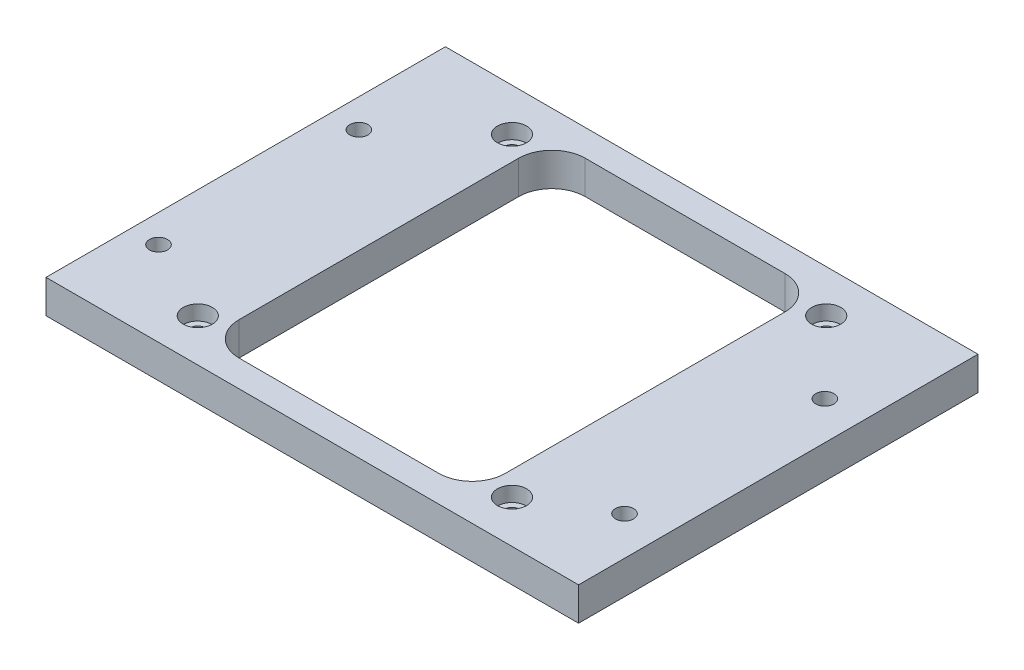
ISO-10303-21;
HEADER;
FILE_DESCRIPTION(('STEP AP214'),'2;1');
FILE_NAME('part.step','',(''),(''),'','','');
FILE_SCHEMA(('AUTOMOTIVE_DESIGN { 1 0 10303 214 1 1 1 1 }'));
ENDSEC;
DATA;
#1=APPLICATION_CONTEXT('core data for automotive mechanical design processes');
#2=APPLICATION_PROTOCOL_DEFINITION('international standard','automotive_design',2000,#1);
#3=PRODUCT_CONTEXT('',#1,'mechanical');
#4=PRODUCT('Part','Part','',(#3));
#5=PRODUCT_RELATED_PRODUCT_CATEGORY('part','',(#4));
#6=PRODUCT_DEFINITION_FORMATION('','',#4);
#7=PRODUCT_DEFINITION_CONTEXT('part definition',#1,'design');
#8=PRODUCT_DEFINITION('design','',#6,#7);
#9=PRODUCT_DEFINITION_SHAPE('','',#8);
#10=(LENGTH_UNIT() NAMED_UNIT(*) SI_UNIT(.MILLI.,.METRE.));
#11=(NAMED_UNIT(*) PLANE_ANGLE_UNIT() SI_UNIT($,.RADIAN.));
#12=(NAMED_UNIT(*) SI_UNIT($,.STERADIAN.) SOLID_ANGLE_UNIT());
#13=UNCERTAINTY_MEASURE_WITH_UNIT(LENGTH_MEASURE(1.E-05),#10,'distance_accuracy_value','');
#14=(GEOMETRIC_REPRESENTATION_CONTEXT(3) GLOBAL_UNCERTAINTY_ASSIGNED_CONTEXT((#13)) GLOBAL_UNIT_ASSIGNED_CONTEXT((#10,
#11,#12)) REPRESENTATION_CONTEXT('',''));
#15=CARTESIAN_POINT('',(0.,0.,0.));
#16=DIRECTION('',(0.,0.,1.));
#17=DIRECTION('',(1.,0.,0.));
#18=AXIS2_PLACEMENT_3D('',#15,#16,#17);
#19=CARTESIAN_POINT('',(0.,6.35,0.));
#20=DIRECTION('',(0.,1.,0.));
#21=DIRECTION('',(0.,0.,1.));
#22=AXIS2_PLACEMENT_3D('',#19,#20,#21);
#23=PLANE('',#22);
#24=CARTESIAN_POINT('',(-45.339,6.35,-16.129));
#25=DIRECTION('',(0.,1.,0.));
#26=DIRECTION('',(0.,0.,1.));
#27=AXIS2_PLACEMENT_3D('',#24,#25,#26);
#28=CIRCLE('',#27,1.7272);
#29=CARTESIAN_POINT('',(-45.339,6.35,-14.4018));
#30=VERTEX_POINT('',#29);
#31=EDGE_CURVE('E357',#30,#30,#28,.T.);
#32=ORIENTED_EDGE('',*,*,#31,.F.);
#33=EDGE_LOOP('',(#32));
#34=FACE_BOUND('',#33,.T.);
#35=CARTESIAN_POINT('',(-45.466,6.35,21.971));
#36=DIRECTION('',(0.,1.,0.));
#37=DIRECTION('',(0.,0.,1.));
#38=AXIS2_PLACEMENT_3D('',#35,#36,#37);
#39=CIRCLE('',#38,1.7272);
#40=CARTESIAN_POINT('',(-45.466,6.35,23.6982));
#41=VERTEX_POINT('',#40);
#42=EDGE_CURVE('E359',#41,#41,#39,.T.);
#43=ORIENTED_EDGE('',*,*,#42,.F.);
#44=EDGE_LOOP('',(#43));
#45=FACE_BOUND('',#44,.T.);
#46=CARTESIAN_POINT('',(43.561,6.35,-16.129));
#47=DIRECTION('',(0.,1.,0.));
#48=DIRECTION('',(0.,0.,1.));
#49=AXIS2_PLACEMENT_3D('',#46,#47,#48);
#50=CIRCLE('',#49,1.7272);
#51=CARTESIAN_POINT('',(43.561,6.35,-14.4018));
#52=VERTEX_POINT('',#51);
#53=EDGE_CURVE('E367',#52,#52,#50,.T.);
#54=ORIENTED_EDGE('',*,*,#53,.F.);
#55=EDGE_LOOP('',(#54));
#56=FACE_BOUND('',#55,.T.);
#57=CARTESIAN_POINT('',(43.434,6.35,21.971));
#58=DIRECTION('',(0.,1.,0.));
#59=DIRECTION('',(0.,0.,1.));
#60=AXIS2_PLACEMENT_3D('',#57,#58,#59);
#61=CIRCLE('',#60,1.7272);
#62=CARTESIAN_POINT('',(43.434,6.35,23.6982));
#63=VERTEX_POINT('',#62);
#64=EDGE_CURVE('E373',#63,#63,#61,.T.);
#65=ORIENTED_EDGE('',*,*,#64,.F.);
#66=EDGE_LOOP('',(#65));
#67=FACE_BOUND('',#66,.T.);
#68=CARTESIAN_POINT('',(-29.972,6.35,-29.972));
#69=DIRECTION('',(0.,1.,0.));
#70=DIRECTION('',(0.,0.,1.));
#71=AXIS2_PLACEMENT_3D('',#68,#69,#70);
#72=CIRCLE('',#71,2.77875999999999);
#73=CARTESIAN_POINT('',(-29.972,6.35,-27.19324));
#74=VERTEX_POINT('',#73);
#75=EDGE_CURVE('E379',#74,#74,#72,.T.);
#76=ORIENTED_EDGE('',*,*,#75,.F.);
#77=EDGE_LOOP('',(#76));
#78=FACE_BOUND('',#77,.T.);
#79=CARTESIAN_POINT('',(29.972,6.35,-29.972));
#80=DIRECTION('',(0.,1.,0.));
#81=DIRECTION('',(0.,0.,1.));
#82=AXIS2_PLACEMENT_3D('',#79,#80,#81);
#83=CIRCLE('',#82,2.77875999999999);
#84=CARTESIAN_POINT('',(29.972,6.35,-27.19324));
#85=VERTEX_POINT('',#84);
#86=EDGE_CURVE('E391',#85,#85,#83,.T.);
#87=ORIENTED_EDGE('',*,*,#86,.F.);
#88=EDGE_LOOP('',(#87));
#89=FACE_BOUND('',#88,.T.);
#90=CARTESIAN_POINT('',(29.972,6.35,29.972));
#91=DIRECTION('',(0.,1.,0.));
#92=DIRECTION('',(0.,0.,1.));
#93=AXIS2_PLACEMENT_3D('',#90,#91,#92);
#94=CIRCLE('',#93,2.77875999999999);
#95=CARTESIAN_POINT('',(29.972,6.35,32.75076));
#96=VERTEX_POINT('',#95);
#97=EDGE_CURVE('E403',#96,#96,#94,.T.);
#98=ORIENTED_EDGE('',*,*,#97,.F.);
#99=EDGE_LOOP('',(#98));
#100=FACE_BOUND('',#99,.T.);
#101=CARTESIAN_POINT('',(-29.972,6.35,29.972));
#102=DIRECTION('',(0.,1.,0.));
#103=DIRECTION('',(0.,0.,1.));
#104=AXIS2_PLACEMENT_3D('',#101,#102,#103);
#105=CIRCLE('',#104,2.77875999999999);
#106=CARTESIAN_POINT('',(-29.972,6.35,32.75076));
#107=VERTEX_POINT('',#106);
#108=EDGE_CURVE('E415',#107,#107,#105,.T.);
#109=ORIENTED_EDGE('',*,*,#108,.F.);
#110=EDGE_LOOP('',(#109));
#111=FACE_BOUND('',#110,.T.);
#112=DIRECTION('',(0.,0.,1.));
#113=VECTOR('',#112,1.);
#114=CARTESIAN_POINT('',(-50.8,6.35,-38.1));
#115=LINE('',#114,#113);
#116=CARTESIAN_POINT('',(-50.8,6.35,-38.1));
#117=VERTEX_POINT('',#116);
#118=CARTESIAN_POINT('',(-50.8,6.35,38.1));
#119=VERTEX_POINT('',#118);
#120=EDGE_CURVE('E191',#117,#119,#115,.T.);
#121=ORIENTED_EDGE('',*,*,#120,.T.);
#122=DIRECTION('',(1.,0.,0.));
#123=VECTOR('',#122,1.);
#124=CARTESIAN_POINT('',(-50.8,6.35,38.1));
#125=LINE('',#124,#123);
#126=CARTESIAN_POINT('',(50.8,6.35,38.1));
#127=VERTEX_POINT('',#126);
#128=EDGE_CURVE('E194',#119,#127,#125,.T.);
#129=ORIENTED_EDGE('',*,*,#128,.T.);
#130=DIRECTION('',(0.,0.,-1.));
#131=VECTOR('',#130,1.);
#132=CARTESIAN_POINT('',(50.8,6.35,-38.1));
#133=LINE('',#132,#131);
#134=CARTESIAN_POINT('',(50.8,6.35,-38.1));
#135=VERTEX_POINT('',#134);
#136=EDGE_CURVE('E197',#127,#135,#133,.T.);
#137=ORIENTED_EDGE('',*,*,#136,.T.);
#138=DIRECTION('',(-1.,0.,0.));
#139=VECTOR('',#138,1.);
#140=CARTESIAN_POINT('',(-50.8,6.35,-38.1));
#141=LINE('',#140,#139);
#142=EDGE_CURVE('E199',#135,#117,#141,.T.);
#143=ORIENTED_EDGE('',*,*,#142,.T.);
#144=EDGE_LOOP('',(#121,#129,#137,#143));
#145=FACE_BOUND('',#144,.T.);
#146=DIRECTION('',(0.,0.,-1.));
#147=VECTOR('',#146,1.);
#148=CARTESIAN_POINT('',(25.4,6.35,-26.67));
#149=LINE('',#148,#147);
#150=CARTESIAN_POINT('',(25.4,6.35,26.67));
#151=VERTEX_POINT('',#150);
#152=CARTESIAN_POINT('',(25.4,6.35,-26.67));
#153=VERTEX_POINT('',#152);
#154=EDGE_CURVE('E132',#151,#153,#149,.T.);
#155=ORIENTED_EDGE('',*,*,#154,.F.);
#156=CARTESIAN_POINT('',(19.05,6.35,26.67));
#157=DIRECTION('',(0.,1.,0.));
#158=DIRECTION('',(0.,0.,1.));
#159=AXIS2_PLACEMENT_3D('',#156,#157,#158);
#160=CIRCLE('',#159,6.35);
#161=CARTESIAN_POINT('',(19.05,6.35,33.02));
#162=VERTEX_POINT('',#161);
#163=EDGE_CURVE('E124',#162,#151,#160,.T.);
#164=ORIENTED_EDGE('',*,*,#163,.F.);
#165=DIRECTION('',(1.,0.,0.));
#166=VECTOR('',#165,1.);
#167=CARTESIAN_POINT('',(-19.05,6.35,33.02));
#168=LINE('',#167,#166);
#169=CARTESIAN_POINT('',(-19.05,6.35,33.02));
#170=VERTEX_POINT('',#169);
#171=EDGE_CURVE('E158',#170,#162,#168,.T.);
#172=ORIENTED_EDGE('',*,*,#171,.F.);
#173=CARTESIAN_POINT('',(-19.05,6.35,26.67));
#174=DIRECTION('',(0.,1.,0.));
#175=DIRECTION('',(0.,0.,-1.));
#176=AXIS2_PLACEMENT_3D('',#173,#174,#175);
#177=CIRCLE('',#176,6.35);
#178=CARTESIAN_POINT('',(-25.4,6.35,26.67));
#179=VERTEX_POINT('',#178);
#180=EDGE_CURVE('E156',#179,#170,#177,.T.);
#181=ORIENTED_EDGE('',*,*,#180,.F.);
#182=DIRECTION('',(0.,0.,1.));
#183=VECTOR('',#182,1.);
#184=CARTESIAN_POINT('',(-25.4,6.35,-26.67));
#185=LINE('',#184,#183);
#186=CARTESIAN_POINT('',(-25.4,6.35,-26.67));
#187=VERTEX_POINT('',#186);
#188=EDGE_CURVE('E154',#187,#179,#185,.T.);
#189=ORIENTED_EDGE('',*,*,#188,.F.);
#190=CARTESIAN_POINT('',(-19.05,6.35,-26.67));
#191=DIRECTION('',(0.,1.,0.));
#192=DIRECTION('',(0.,0.,1.));
#193=AXIS2_PLACEMENT_3D('',#190,#191,#192);
#194=CIRCLE('',#193,6.35);
#195=CARTESIAN_POINT('',(-19.05,6.35,-33.02));
#196=VERTEX_POINT('',#195);
#197=EDGE_CURVE('E152',#196,#187,#194,.T.);
#198=ORIENTED_EDGE('',*,*,#197,.F.);
#199=DIRECTION('',(-1.,0.,0.));
#200=VECTOR('',#199,1.);
#201=CARTESIAN_POINT('',(-19.05,6.35,-33.02));
#202=LINE('',#201,#200);
#203=CARTESIAN_POINT('',(19.05,6.35,-33.02));
#204=VERTEX_POINT('',#203);
#205=EDGE_CURVE('E147',#204,#196,#202,.T.);
#206=ORIENTED_EDGE('',*,*,#205,.F.);
#207=CARTESIAN_POINT('',(19.05,6.35,-26.67));
#208=DIRECTION('',(0.,1.,0.));
#209=DIRECTION('',(0.,0.,-1.));
#210=AXIS2_PLACEMENT_3D('',#207,#208,#209);
#211=CIRCLE('',#210,6.35);
#212=EDGE_CURVE('E145',#153,#204,#211,.T.);
#213=ORIENTED_EDGE('',*,*,#212,.F.);
#214=EDGE_LOOP('',(#155,#164,#172,#181,#189,#198,#206,#213));
#215=FACE_BOUND('',#214,.T.);
#216=ADVANCED_FACE('F35',(#34,#45,#56,#67,#78,#89,#100,#111,#145,#215),#23,.T.);
#217=CARTESIAN_POINT('',(0.,0.,0.));
#218=DIRECTION('',(0.,1.,0.));
#219=DIRECTION('',(0.,0.,1.));
#220=AXIS2_PLACEMENT_3D('',#217,#218,#219);
#221=PLANE('',#220);
#222=CARTESIAN_POINT('',(-45.339,0.,-16.129));
#223=DIRECTION('',(0.,1.,0.));
#224=DIRECTION('',(0.,0.,1.));
#225=AXIS2_PLACEMENT_3D('',#222,#223,#224);
#226=CIRCLE('',#225,1.7272);
#227=CARTESIAN_POINT('',(-45.339,0.,-14.4018));
#228=VERTEX_POINT('',#227);
#229=EDGE_CURVE('E355',#228,#228,#226,.T.);
#230=ORIENTED_EDGE('',*,*,#229,.T.);
#231=EDGE_LOOP('',(#230));
#232=FACE_BOUND('',#231,.T.);
#233=CARTESIAN_POINT('',(-45.466,0.,21.971));
#234=DIRECTION('',(0.,1.,0.));
#235=DIRECTION('',(0.,0.,1.));
#236=AXIS2_PLACEMENT_3D('',#233,#234,#235);
#237=CIRCLE('',#236,1.7272);
#238=CARTESIAN_POINT('',(-45.466,0.,23.6982));
#239=VERTEX_POINT('',#238);
#240=EDGE_CURVE('E364',#239,#239,#237,.T.);
#241=ORIENTED_EDGE('',*,*,#240,.T.);
#242=EDGE_LOOP('',(#241));
#243=FACE_BOUND('',#242,.T.);
#244=CARTESIAN_POINT('',(43.561,0.,-16.129));
#245=DIRECTION('',(0.,1.,0.));
#246=DIRECTION('',(0.,0.,1.));
#247=AXIS2_PLACEMENT_3D('',#244,#245,#246);
#248=CIRCLE('',#247,1.7272);
#249=CARTESIAN_POINT('',(43.561,0.,-14.4018));
#250=VERTEX_POINT('',#249);
#251=EDGE_CURVE('E370',#250,#250,#248,.T.);
#252=ORIENTED_EDGE('',*,*,#251,.T.);
#253=EDGE_LOOP('',(#252));
#254=FACE_BOUND('',#253,.T.);
#255=CARTESIAN_POINT('',(43.434,0.,21.971));
#256=DIRECTION('',(0.,1.,0.));
#257=DIRECTION('',(0.,0.,1.));
#258=AXIS2_PLACEMENT_3D('',#255,#256,#257);
#259=CIRCLE('',#258,1.7272);
#260=CARTESIAN_POINT('',(43.434,0.,23.6982));
#261=VERTEX_POINT('',#260);
#262=EDGE_CURVE('E376',#261,#261,#259,.T.);
#263=ORIENTED_EDGE('',*,*,#262,.T.);
#264=EDGE_LOOP('',(#263));
#265=FACE_BOUND('',#264,.T.);
#266=CARTESIAN_POINT('',(-29.972,0.,-29.972));
#267=DIRECTION('',(0.,1.,0.));
#268=DIRECTION('',(0.,0.,1.));
#269=AXIS2_PLACEMENT_3D('',#266,#267,#268);
#270=CIRCLE('',#269,1.63195);
#271=CARTESIAN_POINT('',(-29.972,0.,-28.34005));
#272=VERTEX_POINT('',#271);
#273=EDGE_CURVE('E388',#272,#272,#270,.T.);
#274=ORIENTED_EDGE('',*,*,#273,.T.);
#275=EDGE_LOOP('',(#274));
#276=FACE_BOUND('',#275,.T.);
#277=CARTESIAN_POINT('',(29.972,0.,-29.972));
#278=DIRECTION('',(0.,1.,0.));
#279=DIRECTION('',(0.,0.,1.));
#280=AXIS2_PLACEMENT_3D('',#277,#278,#279);
#281=CIRCLE('',#280,1.63195);
#282=CARTESIAN_POINT('',(29.972,0.,-28.34005));
#283=VERTEX_POINT('',#282);
#284=EDGE_CURVE('E400',#283,#283,#281,.T.);
#285=ORIENTED_EDGE('',*,*,#284,.T.);
#286=EDGE_LOOP('',(#285));
#287=FACE_BOUND('',#286,.T.);
#288=CARTESIAN_POINT('',(29.972,0.,29.972));
#289=DIRECTION('',(0.,1.,0.));
#290=DIRECTION('',(0.,0.,1.));
#291=AXIS2_PLACEMENT_3D('',#288,#289,#290);
#292=CIRCLE('',#291,1.63195);
#293=CARTESIAN_POINT('',(29.972,0.,31.60395));
#294=VERTEX_POINT('',#293);
#295=EDGE_CURVE('E412',#294,#294,#292,.T.);
#296=ORIENTED_EDGE('',*,*,#295,.T.);
#297=EDGE_LOOP('',(#296));
#298=FACE_BOUND('',#297,.T.);
#299=CARTESIAN_POINT('',(-29.972,0.,29.972));
#300=DIRECTION('',(0.,1.,0.));
#301=DIRECTION('',(0.,0.,1.));
#302=AXIS2_PLACEMENT_3D('',#299,#300,#301);
#303=CIRCLE('',#302,1.63195);
#304=CARTESIAN_POINT('',(-29.972,0.,31.60395));
#305=VERTEX_POINT('',#304);
#306=EDGE_CURVE('E161',#305,#305,#303,.T.);
#307=ORIENTED_EDGE('',*,*,#306,.T.);
#308=EDGE_LOOP('',(#307));
#309=FACE_BOUND('',#308,.T.);
#310=DIRECTION('',(0.,0.,1.));
#311=VECTOR('',#310,1.);
#312=CARTESIAN_POINT('',(-50.8,0.,-38.1));
#313=LINE('',#312,#311);
#314=CARTESIAN_POINT('',(-50.8,0.,-38.1));
#315=VERTEX_POINT('',#314);
#316=CARTESIAN_POINT('',(-50.8,0.,38.1));
#317=VERTEX_POINT('',#316);
#318=EDGE_CURVE('E140',#315,#317,#313,.T.);
#319=ORIENTED_EDGE('',*,*,#318,.F.);
#320=DIRECTION('',(-1.,0.,0.));
#321=VECTOR('',#320,1.);
#322=CARTESIAN_POINT('',(-50.8,0.,-38.1));
#323=LINE('',#322,#321);
#324=CARTESIAN_POINT('',(50.8,0.,-38.1));
#325=VERTEX_POINT('',#324);
#326=EDGE_CURVE('E195',#325,#315,#323,.T.);
#327=ORIENTED_EDGE('',*,*,#326,.F.);
#328=DIRECTION('',(0.,0.,-1.));
#329=VECTOR('',#328,1.);
#330=CARTESIAN_POINT('',(50.8,0.,-38.1));
#331=LINE('',#330,#329);
#332=CARTESIAN_POINT('',(50.8,0.,38.1));
#333=VERTEX_POINT('',#332);
#334=EDGE_CURVE('E206',#333,#325,#331,.T.);
#335=ORIENTED_EDGE('',*,*,#334,.F.);
#336=DIRECTION('',(1.,0.,0.));
#337=VECTOR('',#336,1.);
#338=CARTESIAN_POINT('',(-50.8,0.,38.1));
#339=LINE('',#338,#337);
#340=EDGE_CURVE('E204',#317,#333,#339,.T.);
#341=ORIENTED_EDGE('',*,*,#340,.F.);
#342=EDGE_LOOP('',(#319,#327,#335,#341));
#343=FACE_BOUND('',#342,.T.);
#344=CARTESIAN_POINT('',(19.05,0.,26.67));
#345=DIRECTION('',(0.,1.,0.));
#346=DIRECTION('',(0.,0.,1.));
#347=AXIS2_PLACEMENT_3D('',#344,#345,#346);
#348=CIRCLE('',#347,6.35);
#349=CARTESIAN_POINT('',(19.05,0.,33.02));
#350=VERTEX_POINT('',#349);
#351=CARTESIAN_POINT('',(25.4,0.,26.67));
#352=VERTEX_POINT('',#351);
#353=EDGE_CURVE('E58',#350,#352,#348,.T.);
#354=ORIENTED_EDGE('',*,*,#353,.T.);
#355=DIRECTION('',(0.,0.,-1.));
#356=VECTOR('',#355,1.);
#357=CARTESIAN_POINT('',(25.4,0.,-26.67));
#358=LINE('',#357,#356);
#359=CARTESIAN_POINT('',(25.4,0.,-26.67));
#360=VERTEX_POINT('',#359);
#361=EDGE_CURVE('E139',#352,#360,#358,.T.);
#362=ORIENTED_EDGE('',*,*,#361,.T.);
#363=CARTESIAN_POINT('',(19.05,0.,-26.67));
#364=DIRECTION('',(0.,1.,0.));
#365=DIRECTION('',(0.,0.,-1.));
#366=AXIS2_PLACEMENT_3D('',#363,#364,#365);
#367=CIRCLE('',#366,6.35);
#368=CARTESIAN_POINT('',(19.05,0.,-33.02));
#369=VERTEX_POINT('',#368);
#370=EDGE_CURVE('E163',#360,#369,#367,.T.);
#371=ORIENTED_EDGE('',*,*,#370,.T.);
#372=DIRECTION('',(-1.,0.,0.));
#373=VECTOR('',#372,1.);
#374=CARTESIAN_POINT('',(-19.05,0.,-33.02));
#375=LINE('',#374,#373);
#376=CARTESIAN_POINT('',(-19.05,0.,-33.02));
#377=VERTEX_POINT('',#376);
#378=EDGE_CURVE('E166',#369,#377,#375,.T.);
#379=ORIENTED_EDGE('',*,*,#378,.T.);
#380=CARTESIAN_POINT('',(-19.05,0.,-26.67));
#381=DIRECTION('',(0.,1.,0.));
#382=DIRECTION('',(0.,0.,1.));
#383=AXIS2_PLACEMENT_3D('',#380,#381,#382);
#384=CIRCLE('',#383,6.35);
#385=CARTESIAN_POINT('',(-25.4,0.,-26.67));
#386=VERTEX_POINT('',#385);
#387=EDGE_CURVE('E169',#377,#386,#384,.T.);
#388=ORIENTED_EDGE('',*,*,#387,.T.);
#389=DIRECTION('',(0.,0.,1.));
#390=VECTOR('',#389,1.);
#391=CARTESIAN_POINT('',(-25.4,0.,-26.67));
#392=LINE('',#391,#390);
#393=CARTESIAN_POINT('',(-25.4,0.,26.67));
#394=VERTEX_POINT('',#393);
#395=EDGE_CURVE('E172',#386,#394,#392,.T.);
#396=ORIENTED_EDGE('',*,*,#395,.T.);
#397=CARTESIAN_POINT('',(-19.05,0.,26.67));
#398=DIRECTION('',(0.,1.,0.));
#399=DIRECTION('',(0.,0.,-1.));
#400=AXIS2_PLACEMENT_3D('',#397,#398,#399);
#401=CIRCLE('',#400,6.35);
#402=CARTESIAN_POINT('',(-19.05,0.,33.02));
#403=VERTEX_POINT('',#402);
#404=EDGE_CURVE('E175',#394,#403,#401,.T.);
#405=ORIENTED_EDGE('',*,*,#404,.T.);
#406=DIRECTION('',(1.,0.,0.));
#407=VECTOR('',#406,1.);
#408=CARTESIAN_POINT('',(-19.05,0.,33.02));
#409=LINE('',#408,#407);
#410=EDGE_CURVE('E133',#403,#350,#409,.T.);
#411=ORIENTED_EDGE('',*,*,#410,.T.);
#412=EDGE_LOOP('',(#354,#362,#371,#379,#388,#396,#405,#411));
#413=FACE_BOUND('',#412,.T.);
#414=ADVANCED_FACE('F224',(#232,#243,#254,#265,#276,#287,#298,#309,#343,#413),#221,.F.);
#415=CARTESIAN_POINT('',(-50.8,6.35,-38.1));
#416=DIRECTION('',(1.,0.,0.));
#417=DIRECTION('',(0.,0.,-1.));
#418=AXIS2_PLACEMENT_3D('',#415,#416,#417);
#419=PLANE('',#418);
#420=ORIENTED_EDGE('',*,*,#318,.T.);
#421=DIRECTION('',(0.,-1.,0.));
#422=VECTOR('',#421,1.);
#423=CARTESIAN_POINT('',(-50.8,6.35,38.1));
#424=LINE('',#423,#422);
#425=EDGE_CURVE('E11',#119,#317,#424,.T.);
#426=ORIENTED_EDGE('',*,*,#425,.F.);
#427=ORIENTED_EDGE('',*,*,#120,.F.);
#428=DIRECTION('',(0.,-1.,0.));
#429=VECTOR('',#428,1.);
#430=CARTESIAN_POINT('',(-50.8,6.35,-38.1));
#431=LINE('',#430,#429);
#432=EDGE_CURVE('E201',#117,#315,#431,.T.);
#433=ORIENTED_EDGE('',*,*,#432,.T.);
#434=EDGE_LOOP('',(#420,#426,#427,#433));
#435=FACE_BOUND('',#434,.T.);
#436=ADVANCED_FACE('F37',(#435),#419,.F.);
#437=CARTESIAN_POINT('',(-50.8,6.35,38.1));
#438=DIRECTION('',(0.,0.,-1.));
#439=DIRECTION('',(-1.,0.,0.));
#440=AXIS2_PLACEMENT_3D('',#437,#438,#439);
#441=PLANE('',#440);
#442=ORIENTED_EDGE('',*,*,#340,.T.);
#443=DIRECTION('',(0.,-1.,0.));
#444=VECTOR('',#443,1.);
#445=CARTESIAN_POINT('',(50.8,6.35,38.1));
#446=LINE('',#445,#444);
#447=EDGE_CURVE('E43',#127,#333,#446,.T.);
#448=ORIENTED_EDGE('',*,*,#447,.F.);
#449=ORIENTED_EDGE('',*,*,#128,.F.);
#450=ORIENTED_EDGE('',*,*,#425,.T.);
#451=EDGE_LOOP('',(#442,#448,#449,#450));
#452=FACE_BOUND('',#451,.T.);
#453=ADVANCED_FACE('F234',(#452),#441,.F.);
#454=CARTESIAN_POINT('',(50.8,6.35,-38.1));
#455=DIRECTION('',(-1.,0.,0.));
#456=DIRECTION('',(0.,0.,1.));
#457=AXIS2_PLACEMENT_3D('',#454,#455,#456);
#458=PLANE('',#457);
#459=ORIENTED_EDGE('',*,*,#334,.T.);
#460=DIRECTION('',(0.,-1.,0.));
#461=VECTOR('',#460,1.);
#462=CARTESIAN_POINT('',(50.8,6.35,-38.1));
#463=LINE('',#462,#461);
#464=EDGE_CURVE('E211',#135,#325,#463,.T.);
#465=ORIENTED_EDGE('',*,*,#464,.F.);
#466=ORIENTED_EDGE('',*,*,#136,.F.);
#467=ORIENTED_EDGE('',*,*,#447,.T.);
#468=EDGE_LOOP('',(#459,#465,#466,#467));
#469=FACE_BOUND('',#468,.T.);
#470=ADVANCED_FACE('F218',(#469),#458,.F.);
#471=CARTESIAN_POINT('',(-50.8,6.35,-38.1));
#472=DIRECTION('',(0.,0.,1.));
#473=DIRECTION('',(1.,0.,0.));
#474=AXIS2_PLACEMENT_3D('',#471,#472,#473);
#475=PLANE('',#474);
#476=ORIENTED_EDGE('',*,*,#326,.T.);
#477=ORIENTED_EDGE('',*,*,#432,.F.);
#478=ORIENTED_EDGE('',*,*,#142,.F.);
#479=ORIENTED_EDGE('',*,*,#464,.T.);
#480=EDGE_LOOP('',(#476,#477,#478,#479));
#481=FACE_BOUND('',#480,.T.);
#482=ADVANCED_FACE('F228',(#481),#475,.F.);
#483=CARTESIAN_POINT('',(19.05,6.35,26.67));
#484=DIRECTION('',(0.,-1.,0.));
#485=DIRECTION('',(0.,0.,-1.));
#486=AXIS2_PLACEMENT_3D('',#483,#484,#485);
#487=CYLINDRICAL_SURFACE('',#486,6.35);
#488=ORIENTED_EDGE('',*,*,#353,.F.);
#489=DIRECTION('',(0.,-1.,0.));
#490=VECTOR('',#489,1.);
#491=CARTESIAN_POINT('',(19.05,6.35,33.02));
#492=LINE('',#491,#490);
#493=EDGE_CURVE('E128',#162,#350,#492,.T.);
#494=ORIENTED_EDGE('',*,*,#493,.F.);
#495=ORIENTED_EDGE('',*,*,#163,.T.);
#496=DIRECTION('',(0.,-1.,0.));
#497=VECTOR('',#496,1.);
#498=CARTESIAN_POINT('',(25.4,6.35,26.67));
#499=LINE('',#498,#497);
#500=EDGE_CURVE('E127',#151,#352,#499,.T.);
#501=ORIENTED_EDGE('',*,*,#500,.T.);
#502=EDGE_LOOP('',(#488,#494,#495,#501));
#503=FACE_BOUND('',#502,.T.);
#504=ADVANCED_FACE('F126',(#503),#487,.F.);
#505=CARTESIAN_POINT('',(25.4,6.35,-26.67));
#506=DIRECTION('',(-1.,0.,0.));
#507=DIRECTION('',(0.,0.,1.));
#508=AXIS2_PLACEMENT_3D('',#505,#506,#507);
#509=PLANE('',#508);
#510=ORIENTED_EDGE('',*,*,#361,.F.);
#511=ORIENTED_EDGE('',*,*,#500,.F.);
#512=ORIENTED_EDGE('',*,*,#154,.T.);
#513=DIRECTION('',(0.,-1.,0.));
#514=VECTOR('',#513,1.);
#515=CARTESIAN_POINT('',(25.4,6.35,-26.67));
#516=LINE('',#515,#514);
#517=EDGE_CURVE('E141',#153,#360,#516,.T.);
#518=ORIENTED_EDGE('',*,*,#517,.T.);
#519=EDGE_LOOP('',(#510,#511,#512,#518));
#520=FACE_BOUND('',#519,.T.);
#521=ADVANCED_FACE('F136',(#520),#509,.T.);
#522=CARTESIAN_POINT('',(19.05,6.35,-26.67));
#523=DIRECTION('',(0.,-1.,0.));
#524=DIRECTION('',(0.,0.,-1.));
#525=AXIS2_PLACEMENT_3D('',#522,#523,#524);
#526=CYLINDRICAL_SURFACE('',#525,6.35);
#527=ORIENTED_EDGE('',*,*,#370,.F.);
#528=ORIENTED_EDGE('',*,*,#517,.F.);
#529=ORIENTED_EDGE('',*,*,#212,.T.);
#530=DIRECTION('',(0.,-1.,0.));
#531=VECTOR('',#530,1.);
#532=CARTESIAN_POINT('',(19.05,6.35,-33.02));
#533=LINE('',#532,#531);
#534=EDGE_CURVE('E188',#204,#369,#533,.T.);
#535=ORIENTED_EDGE('',*,*,#534,.T.);
#536=EDGE_LOOP('',(#527,#528,#529,#535));
#537=FACE_BOUND('',#536,.T.);
#538=ADVANCED_FACE('F261',(#537),#526,.F.);
#539=CARTESIAN_POINT('',(-19.05,6.35,-33.02));
#540=DIRECTION('',(0.,0.,1.));
#541=DIRECTION('',(1.,0.,0.));
#542=AXIS2_PLACEMENT_3D('',#539,#540,#541);
#543=PLANE('',#542);
#544=ORIENTED_EDGE('',*,*,#378,.F.);
#545=ORIENTED_EDGE('',*,*,#534,.F.);
#546=ORIENTED_EDGE('',*,*,#205,.T.);
#547=DIRECTION('',(0.,-1.,0.));
#548=VECTOR('',#547,1.);
#549=CARTESIAN_POINT('',(-19.05,6.35,-33.02));
#550=LINE('',#549,#548);
#551=EDGE_CURVE('E186',#196,#377,#550,.T.);
#552=ORIENTED_EDGE('',*,*,#551,.T.);
#553=EDGE_LOOP('',(#544,#545,#546,#552));
#554=FACE_BOUND('',#553,.T.);
#555=ADVANCED_FACE('F265',(#554),#543,.T.);
#556=CARTESIAN_POINT('',(-19.05,6.35,-26.67));
#557=DIRECTION('',(0.,-1.,0.));
#558=DIRECTION('',(0.,0.,-1.));
#559=AXIS2_PLACEMENT_3D('',#556,#557,#558);
#560=CYLINDRICAL_SURFACE('',#559,6.35);
#561=ORIENTED_EDGE('',*,*,#387,.F.);
#562=ORIENTED_EDGE('',*,*,#551,.F.);
#563=ORIENTED_EDGE('',*,*,#197,.T.);
#564=DIRECTION('',(0.,-1.,0.));
#565=VECTOR('',#564,1.);
#566=CARTESIAN_POINT('',(-25.4,6.35,-26.67));
#567=LINE('',#566,#565);
#568=EDGE_CURVE('E184',#187,#386,#567,.T.);
#569=ORIENTED_EDGE('',*,*,#568,.T.);
#570=EDGE_LOOP('',(#561,#562,#563,#569));
#571=FACE_BOUND('',#570,.T.);
#572=ADVANCED_FACE('F271',(#571),#560,.F.);
#573=CARTESIAN_POINT('',(-25.4,6.35,-26.67));
#574=DIRECTION('',(1.,0.,0.));
#575=DIRECTION('',(0.,0.,-1.));
#576=AXIS2_PLACEMENT_3D('',#573,#574,#575);
#577=PLANE('',#576);
#578=ORIENTED_EDGE('',*,*,#395,.F.);
#579=ORIENTED_EDGE('',*,*,#568,.F.);
#580=ORIENTED_EDGE('',*,*,#188,.T.);
#581=DIRECTION('',(0.,-1.,0.));
#582=VECTOR('',#581,1.);
#583=CARTESIAN_POINT('',(-25.4,6.35,26.67));
#584=LINE('',#583,#582);
#585=EDGE_CURVE('E182',#179,#394,#584,.T.);
#586=ORIENTED_EDGE('',*,*,#585,.T.);
#587=EDGE_LOOP('',(#578,#579,#580,#586));
#588=FACE_BOUND('',#587,.T.);
#589=ADVANCED_FACE('F275',(#588),#577,.T.);
#590=CARTESIAN_POINT('',(-19.05,6.35,26.67));
#591=DIRECTION('',(0.,-1.,0.));
#592=DIRECTION('',(0.,0.,-1.));
#593=AXIS2_PLACEMENT_3D('',#590,#591,#592);
#594=CYLINDRICAL_SURFACE('',#593,6.35);
#595=ORIENTED_EDGE('',*,*,#404,.F.);
#596=ORIENTED_EDGE('',*,*,#585,.F.);
#597=ORIENTED_EDGE('',*,*,#180,.T.);
#598=DIRECTION('',(0.,-1.,0.));
#599=VECTOR('',#598,1.);
#600=CARTESIAN_POINT('',(-19.05,6.35,33.02));
#601=LINE('',#600,#599);
#602=EDGE_CURVE('E50',#170,#403,#601,.T.);
#603=ORIENTED_EDGE('',*,*,#602,.T.);
#604=EDGE_LOOP('',(#595,#596,#597,#603));
#605=FACE_BOUND('',#604,.T.);
#606=ADVANCED_FACE('F279',(#605),#594,.F.);
#607=CARTESIAN_POINT('',(-19.05,6.35,33.02));
#608=DIRECTION('',(0.,0.,-1.));
#609=DIRECTION('',(-1.,0.,0.));
#610=AXIS2_PLACEMENT_3D('',#607,#608,#609);
#611=PLANE('',#610);
#612=ORIENTED_EDGE('',*,*,#410,.F.);
#613=ORIENTED_EDGE('',*,*,#602,.F.);
#614=ORIENTED_EDGE('',*,*,#171,.T.);
#615=ORIENTED_EDGE('',*,*,#493,.T.);
#616=EDGE_LOOP('',(#612,#613,#614,#615));
#617=FACE_BOUND('',#616,.T.);
#618=ADVANCED_FACE('F283',(#617),#611,.T.);
#619=CARTESIAN_POINT('',(-29.972,6.35,29.972));
#620=DIRECTION('',(0.,1.,0.));
#621=DIRECTION('',(0.,0.,1.));
#622=AXIS2_PLACEMENT_3D('',#619,#620,#621);
#623=CYLINDRICAL_SURFACE('',#622,1.63195);
#624=ORIENTED_EDGE('',*,*,#306,.F.);
#625=EDGE_LOOP('',(#624));
#626=FACE_BOUND('',#625,.T.);
#627=CARTESIAN_POINT('',(-29.972,3.5052,29.972));
#628=DIRECTION('',(0.,1.,0.));
#629=DIRECTION('',(0.,0.,1.));
#630=AXIS2_PLACEMENT_3D('',#627,#628,#629);
#631=CIRCLE('',#630,1.63195);
#632=CARTESIAN_POINT('',(-29.972,3.5052,31.60395));
#633=VERTEX_POINT('',#632);
#634=EDGE_CURVE('E421',#633,#633,#631,.T.);
#635=ORIENTED_EDGE('',*,*,#634,.T.);
#636=EDGE_LOOP('',(#635));
#637=FACE_BOUND('',#636,.T.);
#638=ADVANCED_FACE('F287',(#626,#637),#623,.F.);
#639=CARTESIAN_POINT('',(-28.34005,3.5052,29.972));
#640=DIRECTION('',(0.,-1.,0.));
#641=DIRECTION('',(0.,0.,-1.));
#642=AXIS2_PLACEMENT_3D('',#639,#640,#641);
#643=PLANE('',#642);
#644=ORIENTED_EDGE('',*,*,#634,.F.);
#645=EDGE_LOOP('',(#644));
#646=FACE_BOUND('',#645,.T.);
#647=CARTESIAN_POINT('',(-29.972,3.5052,29.972));
#648=DIRECTION('',(0.,1.,0.));
#649=DIRECTION('',(0.,0.,1.));
#650=AXIS2_PLACEMENT_3D('',#647,#648,#649);
#651=CIRCLE('',#650,2.77876);
#652=CARTESIAN_POINT('',(-29.972,3.5052,32.75076));
#653=VERTEX_POINT('',#652);
#654=EDGE_CURVE('E418',#653,#653,#651,.T.);
#655=ORIENTED_EDGE('',*,*,#654,.T.);
#656=EDGE_LOOP('',(#655));
#657=FACE_BOUND('',#656,.T.);
#658=ADVANCED_FACE('F290',(#646,#657),#643,.F.);
#659=CARTESIAN_POINT('',(-29.972,6.35,29.972));
#660=DIRECTION('',(0.,1.,0.));
#661=DIRECTION('',(0.,0.,1.));
#662=AXIS2_PLACEMENT_3D('',#659,#660,#661);
#663=CYLINDRICAL_SURFACE('',#662,2.77876);
#664=ORIENTED_EDGE('',*,*,#654,.F.);
#665=EDGE_LOOP('',(#664));
#666=FACE_BOUND('',#665,.T.);
#667=ORIENTED_EDGE('',*,*,#108,.T.);
#668=EDGE_LOOP('',(#667));
#669=FACE_BOUND('',#668,.T.);
#670=ADVANCED_FACE('F294',(#666,#669),#663,.F.);
#671=CARTESIAN_POINT('',(29.972,6.35,29.972));
#672=DIRECTION('',(0.,1.,0.));
#673=DIRECTION('',(0.,0.,1.));
#674=AXIS2_PLACEMENT_3D('',#671,#672,#673);
#675=CYLINDRICAL_SURFACE('',#674,1.63195);
#676=ORIENTED_EDGE('',*,*,#295,.F.);
#677=EDGE_LOOP('',(#676));
#678=FACE_BOUND('',#677,.T.);
#679=CARTESIAN_POINT('',(29.972,3.5052,29.972));
#680=DIRECTION('',(0.,1.,0.));
#681=DIRECTION('',(0.,0.,1.));
#682=AXIS2_PLACEMENT_3D('',#679,#680,#681);
#683=CIRCLE('',#682,1.63195);
#684=CARTESIAN_POINT('',(29.972,3.5052,31.60395));
#685=VERTEX_POINT('',#684);
#686=EDGE_CURVE('E409',#685,#685,#683,.T.);
#687=ORIENTED_EDGE('',*,*,#686,.T.);
#688=EDGE_LOOP('',(#687));
#689=FACE_BOUND('',#688,.T.);
#690=ADVANCED_FACE('F298',(#678,#689),#675,.F.);
#691=CARTESIAN_POINT('',(31.60395,3.5052,29.972));
#692=DIRECTION('',(0.,-1.,0.));
#693=DIRECTION('',(0.,0.,-1.));
#694=AXIS2_PLACEMENT_3D('',#691,#692,#693);
#695=PLANE('',#694);
#696=ORIENTED_EDGE('',*,*,#686,.F.);
#697=EDGE_LOOP('',(#696));
#698=FACE_BOUND('',#697,.T.);
#699=CARTESIAN_POINT('',(29.972,3.5052,29.972));
#700=DIRECTION('',(0.,1.,0.));
#701=DIRECTION('',(0.,0.,1.));
#702=AXIS2_PLACEMENT_3D('',#699,#700,#701);
#703=CIRCLE('',#702,2.77876);
#704=CARTESIAN_POINT('',(29.972,3.5052,32.75076));
#705=VERTEX_POINT('',#704);
#706=EDGE_CURVE('E406',#705,#705,#703,.T.);
#707=ORIENTED_EDGE('',*,*,#706,.T.);
#708=EDGE_LOOP('',(#707));
#709=FACE_BOUND('',#708,.T.);
#710=ADVANCED_FACE('F302',(#698,#709),#695,.F.);
#711=CARTESIAN_POINT('',(29.972,6.35,29.972));
#712=DIRECTION('',(0.,1.,0.));
#713=DIRECTION('',(0.,0.,1.));
#714=AXIS2_PLACEMENT_3D('',#711,#712,#713);
#715=CYLINDRICAL_SURFACE('',#714,2.77876);
#716=ORIENTED_EDGE('',*,*,#706,.F.);
#717=EDGE_LOOP('',(#716));
#718=FACE_BOUND('',#717,.T.);
#719=ORIENTED_EDGE('',*,*,#97,.T.);
#720=EDGE_LOOP('',(#719));
#721=FACE_BOUND('',#720,.T.);
#722=ADVANCED_FACE('F306',(#718,#721),#715,.F.);
#723=CARTESIAN_POINT('',(29.972,6.35,-29.972));
#724=DIRECTION('',(0.,1.,0.));
#725=DIRECTION('',(0.,0.,1.));
#726=AXIS2_PLACEMENT_3D('',#723,#724,#725);
#727=CYLINDRICAL_SURFACE('',#726,1.63195);
#728=ORIENTED_EDGE('',*,*,#284,.F.);
#729=EDGE_LOOP('',(#728));
#730=FACE_BOUND('',#729,.T.);
#731=CARTESIAN_POINT('',(29.972,3.5052,-29.972));
#732=DIRECTION('',(0.,1.,0.));
#733=DIRECTION('',(0.,0.,1.));
#734=AXIS2_PLACEMENT_3D('',#731,#732,#733);
#735=CIRCLE('',#734,1.63195);
#736=CARTESIAN_POINT('',(29.972,3.5052,-28.34005));
#737=VERTEX_POINT('',#736);
#738=EDGE_CURVE('E397',#737,#737,#735,.T.);
#739=ORIENTED_EDGE('',*,*,#738,.T.);
#740=EDGE_LOOP('',(#739));
#741=FACE_BOUND('',#740,.T.);
#742=ADVANCED_FACE('F310',(#730,#741),#727,.F.);
#743=CARTESIAN_POINT('',(31.60395,3.5052,-29.972));
#744=DIRECTION('',(0.,-1.,0.));
#745=DIRECTION('',(0.,0.,-1.));
#746=AXIS2_PLACEMENT_3D('',#743,#744,#745);
#747=PLANE('',#746);
#748=ORIENTED_EDGE('',*,*,#738,.F.);
#749=EDGE_LOOP('',(#748));
#750=FACE_BOUND('',#749,.T.);
#751=CARTESIAN_POINT('',(29.972,3.5052,-29.972));
#752=DIRECTION('',(0.,1.,0.));
#753=DIRECTION('',(0.,0.,1.));
#754=AXIS2_PLACEMENT_3D('',#751,#752,#753);
#755=CIRCLE('',#754,2.77876);
#756=CARTESIAN_POINT('',(29.972,3.5052,-27.19324));
#757=VERTEX_POINT('',#756);
#758=EDGE_CURVE('E394',#757,#757,#755,.T.);
#759=ORIENTED_EDGE('',*,*,#758,.T.);
#760=EDGE_LOOP('',(#759));
#761=FACE_BOUND('',#760,.T.);
#762=ADVANCED_FACE('F314',(#750,#761),#747,.F.);
#763=CARTESIAN_POINT('',(29.972,6.35,-29.972));
#764=DIRECTION('',(0.,1.,0.));
#765=DIRECTION('',(0.,0.,1.));
#766=AXIS2_PLACEMENT_3D('',#763,#764,#765);
#767=CYLINDRICAL_SURFACE('',#766,2.77875999999999);
#768=ORIENTED_EDGE('',*,*,#758,.F.);
#769=EDGE_LOOP('',(#768));
#770=FACE_BOUND('',#769,.T.);
#771=ORIENTED_EDGE('',*,*,#86,.T.);
#772=EDGE_LOOP('',(#771));
#773=FACE_BOUND('',#772,.T.);
#774=ADVANCED_FACE('F318',(#770,#773),#767,.F.);
#775=CARTESIAN_POINT('',(-29.972,6.35,-29.972));
#776=DIRECTION('',(0.,1.,0.));
#777=DIRECTION('',(0.,0.,1.));
#778=AXIS2_PLACEMENT_3D('',#775,#776,#777);
#779=CYLINDRICAL_SURFACE('',#778,1.63195);
#780=ORIENTED_EDGE('',*,*,#273,.F.);
#781=EDGE_LOOP('',(#780));
#782=FACE_BOUND('',#781,.T.);
#783=CARTESIAN_POINT('',(-29.972,3.5052,-29.972));
#784=DIRECTION('',(0.,1.,0.));
#785=DIRECTION('',(0.,0.,1.));
#786=AXIS2_PLACEMENT_3D('',#783,#784,#785);
#787=CIRCLE('',#786,1.63195);
#788=CARTESIAN_POINT('',(-29.972,3.5052,-28.34005));
#789=VERTEX_POINT('',#788);
#790=EDGE_CURVE('E385',#789,#789,#787,.T.);
#791=ORIENTED_EDGE('',*,*,#790,.T.);
#792=EDGE_LOOP('',(#791));
#793=FACE_BOUND('',#792,.T.);
#794=ADVANCED_FACE('F322',(#782,#793),#779,.F.);
#795=CARTESIAN_POINT('',(-28.34005,3.5052,-29.972));
#796=DIRECTION('',(0.,-1.,0.));
#797=DIRECTION('',(0.,0.,-1.));
#798=AXIS2_PLACEMENT_3D('',#795,#796,#797);
#799=PLANE('',#798);
#800=ORIENTED_EDGE('',*,*,#790,.F.);
#801=EDGE_LOOP('',(#800));
#802=FACE_BOUND('',#801,.T.);
#803=CARTESIAN_POINT('',(-29.972,3.5052,-29.972));
#804=DIRECTION('',(0.,1.,0.));
#805=DIRECTION('',(0.,0.,1.));
#806=AXIS2_PLACEMENT_3D('',#803,#804,#805);
#807=CIRCLE('',#806,2.77876);
#808=CARTESIAN_POINT('',(-29.972,3.5052,-27.19324));
#809=VERTEX_POINT('',#808);
#810=EDGE_CURVE('E382',#809,#809,#807,.T.);
#811=ORIENTED_EDGE('',*,*,#810,.T.);
#812=EDGE_LOOP('',(#811));
#813=FACE_BOUND('',#812,.T.);
#814=ADVANCED_FACE('F326',(#802,#813),#799,.F.);
#815=CARTESIAN_POINT('',(-29.972,6.35,-29.972));
#816=DIRECTION('',(0.,1.,0.));
#817=DIRECTION('',(0.,0.,1.));
#818=AXIS2_PLACEMENT_3D('',#815,#816,#817);
#819=CYLINDRICAL_SURFACE('',#818,2.77876);
#820=ORIENTED_EDGE('',*,*,#810,.F.);
#821=EDGE_LOOP('',(#820));
#822=FACE_BOUND('',#821,.T.);
#823=ORIENTED_EDGE('',*,*,#75,.T.);
#824=EDGE_LOOP('',(#823));
#825=FACE_BOUND('',#824,.T.);
#826=ADVANCED_FACE('F330',(#822,#825),#819,.F.);
#827=CARTESIAN_POINT('',(43.434,6.35,21.971));
#828=DIRECTION('',(0.,1.,0.));
#829=DIRECTION('',(0.,0.,1.));
#830=AXIS2_PLACEMENT_3D('',#827,#828,#829);
#831=CYLINDRICAL_SURFACE('',#830,1.7272);
#832=ORIENTED_EDGE('',*,*,#262,.F.);
#833=EDGE_LOOP('',(#832));
#834=FACE_BOUND('',#833,.T.);
#835=ORIENTED_EDGE('',*,*,#64,.T.);
#836=EDGE_LOOP('',(#835));
#837=FACE_BOUND('',#836,.T.);
#838=ADVANCED_FACE('F334',(#834,#837),#831,.F.);
#839=CARTESIAN_POINT('',(43.561,6.35,-16.129));
#840=DIRECTION('',(0.,1.,0.));
#841=DIRECTION('',(0.,0.,1.));
#842=AXIS2_PLACEMENT_3D('',#839,#840,#841);
#843=CYLINDRICAL_SURFACE('',#842,1.7272);
#844=ORIENTED_EDGE('',*,*,#251,.F.);
#845=EDGE_LOOP('',(#844));
#846=FACE_BOUND('',#845,.T.);
#847=ORIENTED_EDGE('',*,*,#53,.T.);
#848=EDGE_LOOP('',(#847));
#849=FACE_BOUND('',#848,.T.);
#850=ADVANCED_FACE('F338',(#846,#849),#843,.F.);
#851=CARTESIAN_POINT('',(-45.466,6.35,21.971));
#852=DIRECTION('',(0.,1.,0.));
#853=DIRECTION('',(0.,0.,1.));
#854=AXIS2_PLACEMENT_3D('',#851,#852,#853);
#855=CYLINDRICAL_SURFACE('',#854,1.7272);
#856=ORIENTED_EDGE('',*,*,#240,.F.);
#857=EDGE_LOOP('',(#856));
#858=FACE_BOUND('',#857,.T.);
#859=ORIENTED_EDGE('',*,*,#42,.T.);
#860=EDGE_LOOP('',(#859));
#861=FACE_BOUND('',#860,.T.);
#862=ADVANCED_FACE('F342',(#858,#861),#855,.F.);
#863=CARTESIAN_POINT('',(-45.339,6.35,-16.129));
#864=DIRECTION('',(0.,1.,0.));
#865=DIRECTION('',(0.,0.,1.));
#866=AXIS2_PLACEMENT_3D('',#863,#864,#865);
#867=CYLINDRICAL_SURFACE('',#866,1.7272);
#868=ORIENTED_EDGE('',*,*,#229,.F.);
#869=EDGE_LOOP('',(#868));
#870=FACE_BOUND('',#869,.T.);
#871=ORIENTED_EDGE('',*,*,#31,.T.);
#872=EDGE_LOOP('',(#871));
#873=FACE_BOUND('',#872,.T.);
#874=ADVANCED_FACE('F346',(#870,#873),#867,.F.);
#875=CLOSED_SHELL('',(#216,#414,#436,#453,#470,#482,#504,#521,#538,#555,#572,#589,#606,#618,
#638,#658,#670,#690,#710,#722,#742,#762,#774,#794,#814,#826,#838,#850,#862,#874));
#876=MANIFOLD_SOLID_BREP('B2',#875);
#877=ADVANCED_BREP_SHAPE_REPRESENTATION('',(#18,#876),#14);
#878=SHAPE_DEFINITION_REPRESENTATION(#9,#877);
ENDSEC;
END-ISO-10303-21;
